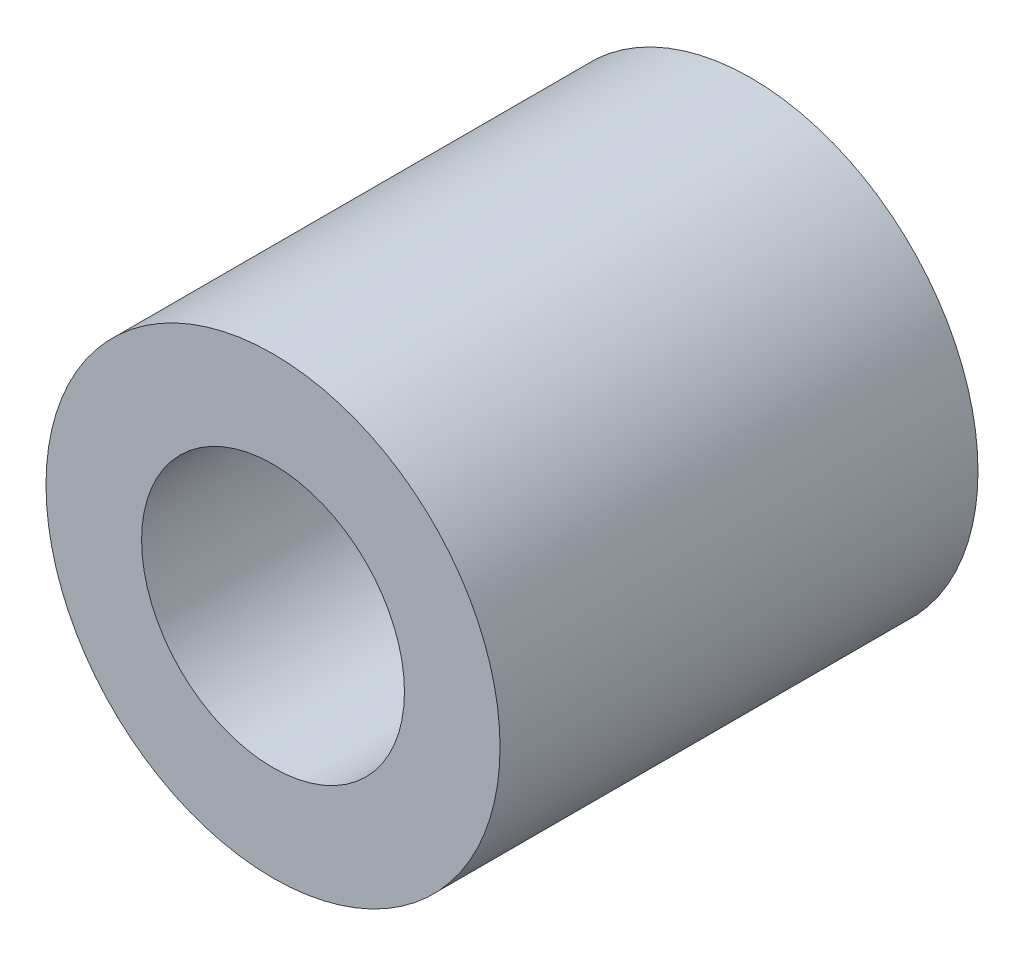
ISO-10303-21;
HEADER;
FILE_DESCRIPTION(('STEP AP214'),'2;1');
FILE_NAME('part.step','',(''),(''),'','','');
FILE_SCHEMA(('AUTOMOTIVE_DESIGN { 1 0 10303 214 1 1 1 1 }'));
ENDSEC;
DATA;
#1=APPLICATION_CONTEXT('core data for automotive mechanical design processes');
#2=APPLICATION_PROTOCOL_DEFINITION('international standard','automotive_design',2000,#1);
#3=PRODUCT_CONTEXT('',#1,'mechanical');
#4=PRODUCT('Part','Part','',(#3));
#5=PRODUCT_RELATED_PRODUCT_CATEGORY('part','',(#4));
#6=PRODUCT_DEFINITION_FORMATION('','',#4);
#7=PRODUCT_DEFINITION_CONTEXT('part definition',#1,'design');
#8=PRODUCT_DEFINITION('design','',#6,#7);
#9=PRODUCT_DEFINITION_SHAPE('','',#8);
#10=(LENGTH_UNIT() NAMED_UNIT(*) SI_UNIT(.MILLI.,.METRE.));
#11=(NAMED_UNIT(*) PLANE_ANGLE_UNIT() SI_UNIT($,.RADIAN.));
#12=(NAMED_UNIT(*) SI_UNIT($,.STERADIAN.) SOLID_ANGLE_UNIT());
#13=UNCERTAINTY_MEASURE_WITH_UNIT(LENGTH_MEASURE(1.E-05),#10,'distance_accuracy_value','');
#14=(GEOMETRIC_REPRESENTATION_CONTEXT(3) GLOBAL_UNCERTAINTY_ASSIGNED_CONTEXT((#13)) GLOBAL_UNIT_ASSIGNED_CONTEXT((#10,
#11,#12)) REPRESENTATION_CONTEXT('',''));
#15=CARTESIAN_POINT('',(0.,0.,0.));
#16=DIRECTION('',(0.,0.,1.));
#17=DIRECTION('',(1.,0.,0.));
#18=AXIS2_PLACEMENT_3D('',#15,#16,#17);
#19=CARTESIAN_POINT('',(0.,0.,10.));
#20=DIRECTION('',(0.,0.,1.));
#21=DIRECTION('',(1.,0.,0.));
#22=AXIS2_PLACEMENT_3D('',#19,#20,#21);
#23=PLANE('',#22);
#24=CARTESIAN_POINT('',(0.,0.,10.));
#25=DIRECTION('',(0.,0.,1.));
#26=DIRECTION('',(1.,0.,0.));
#27=AXIS2_PLACEMENT_3D('',#24,#25,#26);
#28=CIRCLE('',#27,4.75);
#29=CARTESIAN_POINT('',(4.75,0.,10.));
#30=VERTEX_POINT('',#29);
#31=EDGE_CURVE('E10',#30,#30,#28,.T.);
#32=ORIENTED_EDGE('',*,*,#31,.T.);
#33=EDGE_LOOP('',(#32));
#34=FACE_BOUND('',#33,.T.);
#35=CARTESIAN_POINT('',(0.,0.,10.));
#36=DIRECTION('',(0.,0.,1.));
#37=DIRECTION('',(1.,0.,0.));
#38=AXIS2_PLACEMENT_3D('',#35,#36,#37);
#39=CIRCLE('',#38,2.75);
#40=CARTESIAN_POINT('',(2.75,0.,10.));
#41=VERTEX_POINT('',#40);
#42=EDGE_CURVE('E54',#41,#41,#39,.T.);
#43=ORIENTED_EDGE('',*,*,#42,.F.);
#44=EDGE_LOOP('',(#43));
#45=FACE_BOUND('',#44,.T.);
#46=ADVANCED_FACE('F41',(#34,#45),#23,.T.);
#47=CARTESIAN_POINT('',(0.,0.,0.));
#48=DIRECTION('',(0.,0.,1.));
#49=DIRECTION('',(1.,0.,0.));
#50=AXIS2_PLACEMENT_3D('',#47,#48,#49);
#51=PLANE('',#50);
#52=CARTESIAN_POINT('',(0.,0.,0.));
#53=DIRECTION('',(0.,0.,1.));
#54=DIRECTION('',(1.,0.,0.));
#55=AXIS2_PLACEMENT_3D('',#52,#53,#54);
#56=CIRCLE('',#55,4.75);
#57=CARTESIAN_POINT('',(4.75,0.,0.));
#58=VERTEX_POINT('',#57);
#59=EDGE_CURVE('E45',#58,#58,#56,.T.);
#60=ORIENTED_EDGE('',*,*,#59,.F.);
#61=EDGE_LOOP('',(#60));
#62=FACE_BOUND('',#61,.T.);
#63=CARTESIAN_POINT('',(0.,0.,0.));
#64=DIRECTION('',(0.,0.,1.));
#65=DIRECTION('',(1.,0.,0.));
#66=AXIS2_PLACEMENT_3D('',#63,#64,#65);
#67=CIRCLE('',#66,2.75);
#68=CARTESIAN_POINT('',(2.75,0.,0.));
#69=VERTEX_POINT('',#68);
#70=EDGE_CURVE('E56',#69,#69,#67,.T.);
#71=ORIENTED_EDGE('',*,*,#70,.T.);
#72=EDGE_LOOP('',(#71));
#73=FACE_BOUND('',#72,.T.);
#74=ADVANCED_FACE('F68',(#62,#73),#51,.F.);
#75=CARTESIAN_POINT('',(0.,0.,10.));
#76=DIRECTION('',(0.,0.,-1.));
#77=DIRECTION('',(-1.,0.,0.));
#78=AXIS2_PLACEMENT_3D('',#75,#76,#77);
#79=CYLINDRICAL_SURFACE('',#78,4.75);
#80=ORIENTED_EDGE('',*,*,#31,.F.);
#81=EDGE_LOOP('',(#80));
#82=FACE_BOUND('',#81,.T.);
#83=ORIENTED_EDGE('',*,*,#59,.T.);
#84=EDGE_LOOP('',(#83));
#85=FACE_BOUND('',#84,.T.);
#86=ADVANCED_FACE('F43',(#82,#85),#79,.T.);
#87=CARTESIAN_POINT('',(0.,0.,10.));
#88=DIRECTION('',(0.,0.,-1.));
#89=DIRECTION('',(-1.,0.,0.));
#90=AXIS2_PLACEMENT_3D('',#87,#88,#89);
#91=CYLINDRICAL_SURFACE('',#90,2.75);
#92=ORIENTED_EDGE('',*,*,#42,.T.);
#93=EDGE_LOOP('',(#92));
#94=FACE_BOUND('',#93,.T.);
#95=ORIENTED_EDGE('',*,*,#70,.F.);
#96=EDGE_LOOP('',(#95));
#97=FACE_BOUND('',#96,.T.);
#98=ADVANCED_FACE('F64',(#94,#97),#91,.F.);
#99=CLOSED_SHELL('',(#46,#74,#86,#98));
#100=MANIFOLD_SOLID_BREP('B2',#99);
#101=ADVANCED_BREP_SHAPE_REPRESENTATION('',(#18,#100),#14);
#102=SHAPE_DEFINITION_REPRESENTATION(#9,#101);
ENDSEC;
END-ISO-10303-21;
